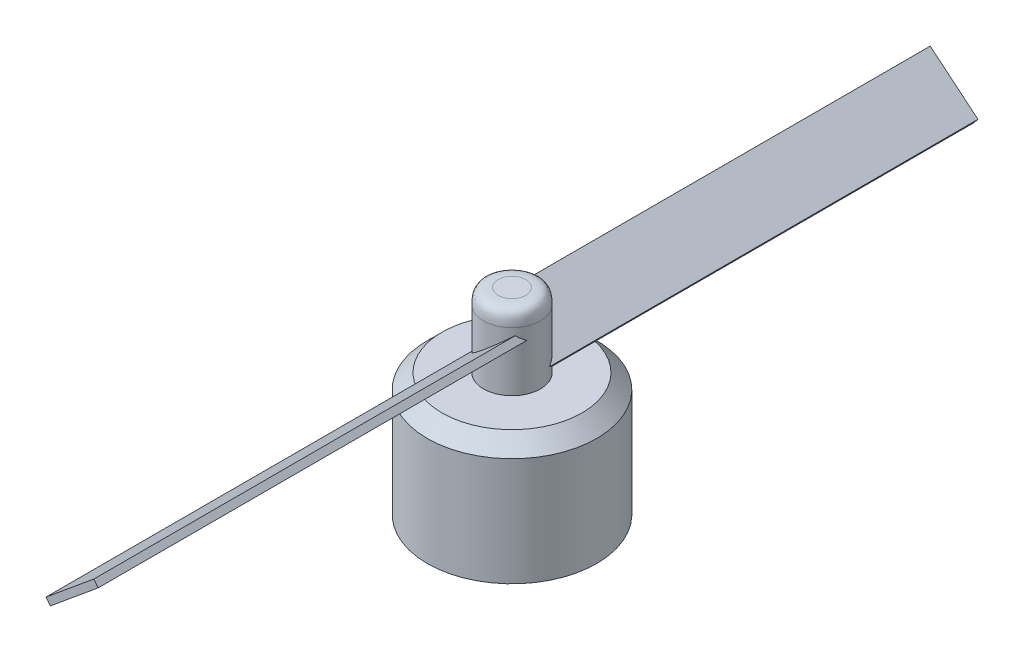
ISO-10303-21;
HEADER;
FILE_DESCRIPTION(('STEP AP214'),'2;1');
FILE_NAME('part.step','',(''),(''),'','','');
FILE_SCHEMA(('AUTOMOTIVE_DESIGN { 1 0 10303 214 1 1 1 1 }'));
ENDSEC;
DATA;
#1=APPLICATION_CONTEXT('core data for automotive mechanical design processes');
#2=APPLICATION_PROTOCOL_DEFINITION('international standard','automotive_design',2000,#1);
#3=PRODUCT_CONTEXT('',#1,'mechanical');
#4=PRODUCT('Part','Part','',(#3));
#5=PRODUCT_RELATED_PRODUCT_CATEGORY('part','',(#4));
#6=PRODUCT_DEFINITION_FORMATION('','',#4);
#7=PRODUCT_DEFINITION_CONTEXT('part definition',#1,'design');
#8=PRODUCT_DEFINITION('design','',#6,#7);
#9=PRODUCT_DEFINITION_SHAPE('','',#8);
#10=(LENGTH_UNIT() NAMED_UNIT(*) SI_UNIT(.MILLI.,.METRE.));
#11=(NAMED_UNIT(*) PLANE_ANGLE_UNIT() SI_UNIT($,.RADIAN.));
#12=(NAMED_UNIT(*) SI_UNIT($,.STERADIAN.) SOLID_ANGLE_UNIT());
#13=UNCERTAINTY_MEASURE_WITH_UNIT(LENGTH_MEASURE(1.E-05),#10,'distance_accuracy_value','');
#14=(GEOMETRIC_REPRESENTATION_CONTEXT(3) GLOBAL_UNCERTAINTY_ASSIGNED_CONTEXT((#13)) GLOBAL_UNIT_ASSIGNED_CONTEXT((#10,
#11,#12)) REPRESENTATION_CONTEXT('',''));
#15=CARTESIAN_POINT('',(0.,0.,0.));
#16=DIRECTION('',(0.,0.,1.));
#17=DIRECTION('',(1.,0.,0.));
#18=AXIS2_PLACEMENT_3D('',#15,#16,#17);
#19=CARTESIAN_POINT('',(0.,26.7,0.));
#20=DIRECTION('',(0.,-1.,0.));
#21=DIRECTION('',(0.,0.,-1.));
#22=AXIS2_PLACEMENT_3D('',#19,#20,#21);
#23=CYLINDRICAL_SURFACE('',#22,3.858432037408);
#24=CARTESIAN_POINT('',(0.,24.7,3.858432037408));
#25=CARTESIAN_POINT('',(0.505067548256472,24.7,3.858432037408));
#26=CARTESIAN_POINT('',(1.00993644525316,24.7,3.75800736988997));
#27=CARTESIAN_POINT('',(1.94317958599228,24.7,3.37144540400417));
#28=CARTESIAN_POINT('',(2.37118677006934,24.7,3.0854601467279));
#29=CARTESIAN_POINT('',(3.0854601467279,24.7,2.37118677006934));
#30=CARTESIAN_POINT('',(3.37144540400415,24.7,1.94317958599232));
#31=CARTESIAN_POINT('',(3.75800736988999,24.7,1.00993644525312));
#32=CARTESIAN_POINT('',(3.858432037408,24.7,0.505067548256251));
#33=CARTESIAN_POINT('',(3.858432037408,24.7,-0.50506754825625));
#34=CARTESIAN_POINT('',(3.75800736989,24.7,-1.0099364452531));
#35=CARTESIAN_POINT('',(3.37144540400414,24.7,-1.94317958599234));
#36=CARTESIAN_POINT('',(3.08546014672787,24.7,-2.37118677006938));
#37=CARTESIAN_POINT('',(2.37118677006937,24.7,-3.08546014672787));
#38=CARTESIAN_POINT('',(1.94317958599235,24.7,-3.37144540400414));
#39=CARTESIAN_POINT('',(1.00993644525309,24.7,-3.75800736989));
#40=CARTESIAN_POINT('',(0.505067548256251,24.7,-3.858432037408));
#41=CARTESIAN_POINT('',(-0.50506754825625,24.7,-3.858432037408));
#42=CARTESIAN_POINT('',(-1.00993644525304,24.7,-3.75800736989002));
#43=CARTESIAN_POINT('',(-1.94317958599239,24.7,-3.37144540400412));
#44=CARTESIAN_POINT('',(-2.37118677006937,24.7,-3.08546014672787));
#45=CARTESIAN_POINT('',(-3.08546014672787,24.7,-2.37118677006937));
#46=CARTESIAN_POINT('',(-3.37144540400413,24.7,-1.94317958599236));
#47=CARTESIAN_POINT('',(-3.75800736989001,24.7,-1.00993644525308));
#48=CARTESIAN_POINT('',(-3.858432037408,24.7,-0.505067548256245));
#49=CARTESIAN_POINT('',(-3.85843203740799,24.7,0.505067548256257));
#50=CARTESIAN_POINT('',(-3.75800736988998,24.7,1.00993644525313));
#51=CARTESIAN_POINT('',(-3.37144540400416,24.7,1.94317958599229));
#52=CARTESIAN_POINT('',(-3.08546014672784,24.7,2.37118677006939));
#53=CARTESIAN_POINT('',(-2.37118677006941,24.7,3.08546014672783));
#54=CARTESIAN_POINT('',(-1.94317958599236,24.7,3.37144540400413));
#55=CARTESIAN_POINT('',(-1.00993644525309,24.7,3.75800736989));
#56=CARTESIAN_POINT('',(-0.505067548256473,24.7,3.858432037408));
#57=CARTESIAN_POINT('',(0.,24.7,3.858432037408));
#58=(BOUNDED_CURVE() B_SPLINE_CURVE(3,(#24,#25,#26,#27,#28,#29,#30,#31,#32,#33,#34,#35,#36,#37,
#38,#39,#40,#41,#42,#43,#44,#45,#46,#47,#48,#49,#50,#51,#52,#53,#54,#55,#56,#57),.UNSPECIFIED.,
.T.,.F.) B_SPLINE_CURVE_WITH_KNOTS((4,2,2,2,2,2,2,2,2,2,2,2,2,2,2,2,4),(0.,0.392699081698724,
0.785398163397448,1.17809724509617,1.5707963267949,1.96349540849362,2.35619449019234,
2.74889357189107,3.14159265358979,3.53429173528852,3.92699081698724,4.31968989868597,
4.71238898038469,5.10508806208341,5.49778714378214,5.89048622548086,6.28318530717959),
.UNSPECIFIED.) CURVE() GEOMETRIC_REPRESENTATION_ITEM() RATIONAL_B_SPLINE_CURVE((1.,1.,1.,1.,1.,
1.,1.,1.,1.,1.,1.,1.,1.,1.,1.,1.,1.,1.,1.,1.,1.,1.,1.,1.,1.,1.,1.,1.,1.,1.,1.,1.,1.,1.)) REPRESENTATION_ITEM(''));
#59=CARTESIAN_POINT('',(0.,24.7,3.858432037408));
#60=VERTEX_POINT('',#59);
#61=EDGE_CURVE('E12',#60,#60,#58,.F.);
#62=ORIENTED_EDGE('',*,*,#61,.T.);
#63=EDGE_LOOP('',(#62));
#64=FACE_BOUND('',#63,.T.);
#65=CARTESIAN_POINT('',(0.,14.0969897316671,0.));
#66=DIRECTION('',(0.770742318559138,0.637146983342215,0.));
#67=DIRECTION('',(0.637146983342215,-0.770742318559138,0.));
#68=AXIS2_PLACEMENT_3D('',#65,#66,#67);
#69=ELLIPSE('',#68,6.05579581836553,3.858432037408);
#70=CARTESIAN_POINT('',(-3.54548194800131,18.3858791848945,1.52218774916017));
#71=VERTEX_POINT('',#70);
#72=CARTESIAN_POINT('',(-2.93967968421916,17.6530538658032,2.49915608585892));
#73=VERTEX_POINT('',#72);
#74=EDGE_CURVE('E178',#71,#73,#69,.T.);
#75=ORIENTED_EDGE('',*,*,#74,.F.);
#76=CARTESIAN_POINT('',(0.,21.3168109285756,0.));
#77=DIRECTION('',(0.637146983342215,-0.770742318559137,0.));
#78=DIRECTION('',(-0.770742318559138,-0.637146983342215,0.));
#79=AXIS2_PLACEMENT_3D('',#76,#77,#78);
#80=ELLIPSE('',#79,5.00612454318213,3.858432037408);
#81=CARTESIAN_POINT('',(2.93967968421918,23.7469461341968,2.4991560858589));
#82=VERTEX_POINT('',#81);
#83=EDGE_CURVE('E169',#82,#71,#80,.T.);
#84=ORIENTED_EDGE('',*,*,#83,.F.);
#85=CARTESIAN_POINT('',(0.,27.3030102683329,0.));
#86=DIRECTION('',(-0.770742318559139,-0.637146983342214,0.));
#87=DIRECTION('',(0.637146983342214,-0.770742318559139,0.));
#88=AXIS2_PLACEMENT_3D('',#85,#86,#87);
#89=ELLIPSE('',#88,6.05579581836554,3.858432037408);
#90=CARTESIAN_POINT('',(3.54548194800133,23.0141208151055,1.5221877491601));
#91=VERTEX_POINT('',#90);
#92=EDGE_CURVE('E172',#91,#82,#89,.T.);
#93=ORIENTED_EDGE('',*,*,#92,.F.);
#94=CARTESIAN_POINT('',(0.,20.0831890714244,0.));
#95=DIRECTION('',(-0.637146983342215,0.770742318559137,0.));
#96=DIRECTION('',(-0.770742318559138,-0.637146983342215,0.));
#97=AXIS2_PLACEMENT_3D('',#94,#95,#96);
#98=ELLIPSE('',#97,5.00612454318213,3.858432037408);
#99=EDGE_CURVE('E175',#73,#91,#98,.T.);
#100=ORIENTED_EDGE('',*,*,#99,.F.);
#101=EDGE_LOOP('',(#75,#84,#93,#100));
#102=FACE_BOUND('',#101,.T.);
#103=CARTESIAN_POINT('',(0.,16.7,0.));
#104=DIRECTION('',(0.,1.,0.));
#105=DIRECTION('',(0.,0.,1.));
#106=AXIS2_PLACEMENT_3D('',#103,#104,#105);
#107=CIRCLE('',#106,3.858432037408);
#108=CARTESIAN_POINT('',(0.,16.7,3.858432037408));
#109=VERTEX_POINT('',#108);
#110=EDGE_CURVE('E157',#109,#109,#107,.T.);
#111=ORIENTED_EDGE('',*,*,#110,.T.);
#112=EDGE_LOOP('',(#111));
#113=FACE_BOUND('',#112,.T.);
#114=CARTESIAN_POINT('',(0.,14.0969897316671,0.));
#115=DIRECTION('',(-0.770742318559138,0.637146983342215,0.));
#116=DIRECTION('',(-0.637146983342215,-0.770742318559138,0.));
#117=AXIS2_PLACEMENT_3D('',#114,#115,#116);
#118=ELLIPSE('',#117,6.05579581836553,3.858432037408);
#119=CARTESIAN_POINT('',(3.54548194800131,18.3858791848945,-1.52218774916017));
#120=VERTEX_POINT('',#119);
#121=CARTESIAN_POINT('',(2.93967968421916,17.6530538658032,-2.49915608585892));
#122=VERTEX_POINT('',#121);
#123=EDGE_CURVE('E130',#120,#122,#118,.T.);
#124=ORIENTED_EDGE('',*,*,#123,.F.);
#125=CARTESIAN_POINT('',(0.,21.3168109285756,0.));
#126=DIRECTION('',(-0.637146983342215,-0.770742318559137,0.));
#127=DIRECTION('',(0.770742318559138,-0.637146983342215,0.));
#128=AXIS2_PLACEMENT_3D('',#125,#126,#127);
#129=ELLIPSE('',#128,5.00612454318213,3.858432037408);
#130=CARTESIAN_POINT('',(-2.93967968421918,23.7469461341968,-2.4991560858589));
#131=VERTEX_POINT('',#130);
#132=EDGE_CURVE('E181',#131,#120,#129,.T.);
#133=ORIENTED_EDGE('',*,*,#132,.F.);
#134=CARTESIAN_POINT('',(0.,27.3030102683329,0.));
#135=DIRECTION('',(0.770742318559139,-0.637146983342214,0.));
#136=DIRECTION('',(-0.637146983342214,-0.770742318559139,0.));
#137=AXIS2_PLACEMENT_3D('',#134,#135,#136);
#138=ELLIPSE('',#137,6.05579581836554,3.858432037408);
#139=CARTESIAN_POINT('',(-3.54548194800133,23.0141208151055,-1.5221877491601));
#140=VERTEX_POINT('',#139);
#141=EDGE_CURVE('E66',#140,#131,#138,.T.);
#142=ORIENTED_EDGE('',*,*,#141,.F.);
#143=CARTESIAN_POINT('',(0.,20.0831890714244,0.));
#144=DIRECTION('',(0.637146983342215,0.770742318559137,0.));
#145=DIRECTION('',(0.770742318559138,-0.637146983342215,0.));
#146=AXIS2_PLACEMENT_3D('',#143,#144,#145);
#147=ELLIPSE('',#146,5.00612454318213,3.858432037408);
#148=EDGE_CURVE('E61',#122,#140,#147,.T.);
#149=ORIENTED_EDGE('',*,*,#148,.F.);
#150=EDGE_LOOP('',(#124,#133,#142,#149));
#151=FACE_BOUND('',#150,.T.);
#152=ADVANCED_FACE('F40',(#64,#102,#113,#151),#23,.T.);
#153=CARTESIAN_POINT('',(0.,16.7,0.));
#154=DIRECTION('',(0.,1.,0.));
#155=DIRECTION('',(0.,0.,1.));
#156=AXIS2_PLACEMENT_3D('',#153,#154,#155);
#157=PLANE('',#156);
#158=CARTESIAN_POINT('',(0.,16.7,0.));
#159=DIRECTION('',(0.,1.,0.));
#160=DIRECTION('',(0.,0.,1.));
#161=AXIS2_PLACEMENT_3D('',#158,#159,#160);
#162=CIRCLE('',#161,9.49999999999999);
#163=CARTESIAN_POINT('',(0.,16.7,9.49999999999999));
#164=VERTEX_POINT('',#163);
#165=EDGE_CURVE('E163',#164,#164,#162,.T.);
#166=ORIENTED_EDGE('',*,*,#165,.T.);
#167=EDGE_LOOP('',(#166));
#168=FACE_BOUND('',#167,.T.);
#169=ORIENTED_EDGE('',*,*,#110,.F.);
#170=EDGE_LOOP('',(#169));
#171=FACE_BOUND('',#170,.T.);
#172=ADVANCED_FACE('F210',(#168,#171),#157,.T.);
#173=CARTESIAN_POINT('',(0.,16.7,0.));
#174=DIRECTION('',(0.,-1.,0.));
#175=DIRECTION('',(0.,0.,-1.));
#176=AXIS2_PLACEMENT_3D('',#173,#174,#175);
#177=CYLINDRICAL_SURFACE('',#176,11.5);
#178=CARTESIAN_POINT('',(0.,14.7,0.));
#179=DIRECTION('',(0.,1.,0.));
#180=DIRECTION('',(0.,0.,1.));
#181=AXIS2_PLACEMENT_3D('',#178,#179,#180);
#182=CIRCLE('',#181,11.5);
#183=CARTESIAN_POINT('',(0.,14.7,11.5));
#184=VERTEX_POINT('',#183);
#185=EDGE_CURVE('E166',#184,#184,#182,.F.);
#186=ORIENTED_EDGE('',*,*,#185,.T.);
#187=EDGE_LOOP('',(#186));
#188=FACE_BOUND('',#187,.T.);
#189=CARTESIAN_POINT('',(0.,0.,0.));
#190=DIRECTION('',(0.,1.,0.));
#191=DIRECTION('',(0.,0.,1.));
#192=AXIS2_PLACEMENT_3D('',#189,#190,#191);
#193=CIRCLE('',#192,11.5);
#194=CARTESIAN_POINT('',(0.,0.,11.5));
#195=VERTEX_POINT('',#194);
#196=EDGE_CURVE('E160',#195,#195,#193,.T.);
#197=ORIENTED_EDGE('',*,*,#196,.T.);
#198=EDGE_LOOP('',(#197));
#199=FACE_BOUND('',#198,.T.);
#200=ADVANCED_FACE('F213',(#188,#199),#177,.T.);
#201=CARTESIAN_POINT('',(0.,0.,0.));
#202=DIRECTION('',(0.,1.,0.));
#203=DIRECTION('',(0.,0.,1.));
#204=AXIS2_PLACEMENT_3D('',#201,#202,#203);
#205=PLANE('',#204);
#206=ORIENTED_EDGE('',*,*,#196,.F.);
#207=EDGE_LOOP('',(#206));
#208=FACE_BOUND('',#207,.T.);
#209=ADVANCED_FACE('F215',(#208),#205,.F.);
#210=CARTESIAN_POINT('',(0.,16.7,0.));
#211=DIRECTION('',(0.,-1.,0.));
#212=DIRECTION('',(0.,0.,-1.));
#213=AXIS2_PLACEMENT_3D('',#210,#211,#212);
#214=CONICAL_SURFACE('',#213,9.49999999999999,0.785398163397447);
#215=ORIENTED_EDGE('',*,*,#185,.F.);
#216=EDGE_LOOP('',(#215));
#217=FACE_BOUND('',#216,.T.);
#218=ORIENTED_EDGE('',*,*,#165,.F.);
#219=EDGE_LOOP('',(#218));
#220=FACE_BOUND('',#219,.T.);
#221=ADVANCED_FACE('F207',(#217,#220),#214,.T.);
#222=CARTESIAN_POINT('',(0.,26.7,0.));
#223=DIRECTION('',(0.,1.,0.));
#224=DIRECTION('',(0.,0.,1.));
#225=AXIS2_PLACEMENT_3D('',#222,#223,#224);
#226=PLANE('',#225);
#227=CARTESIAN_POINT('',(0.,26.7,1.85843203740799));
#228=CARTESIAN_POINT('',(-0.0304078490313098,26.7,1.85843208659817));
#229=CARTESIAN_POINT('',(-0.0608150898767952,26.7,1.85767629258384));
#230=CARTESIAN_POINT('',(-0.121554992538284,26.7,1.85466735708799));
#231=CARTESIAN_POINT('',(-0.151887655549828,26.7,1.8524142397689));
#232=CARTESIAN_POINT('',(-0.212406572366194,26.7,1.84642494160648));
#233=CARTESIAN_POINT('',(-0.242592823517303,26.7,1.8426887339831));
#234=CARTESIAN_POINT('',(-0.302747511845807,26.7,1.83374752947818));
#235=CARTESIAN_POINT('',(-0.332715945164357,26.7,1.82854250663998));
#236=CARTESIAN_POINT('',(-0.392363471023844,26.7,1.81667787729016));
#237=CARTESIAN_POINT('',(-0.42204256356478,26.7,1.81001827077856));
#238=CARTESIAN_POINT('',(-0.481039910513281,26.7,1.79525865695951));
#239=CARTESIAN_POINT('',(-0.510358171288539,26.7,1.78715867510984));
#240=CARTESIAN_POINT('',(-0.568562321423554,26.7,1.76953250414313));
#241=CARTESIAN_POINT('',(-0.597448218581264,26.7,1.76000634078236));
#242=CARTESIAN_POINT('',(-0.654716204909586,26.7,1.73954198389621));
#243=CARTESIAN_POINT('',(-0.683098285942751,26.7,1.72860376758745));
#244=CARTESIAN_POINT('',(-0.739284015842332,26.7,1.70533087626154));
#245=CARTESIAN_POINT('',(-0.767087664708751,26.7,1.69299620124441));
#246=CARTESIAN_POINT('',(-0.822052731750569,26.7,1.66697210523672));
#247=CARTESIAN_POINT('',(-0.84921416028221,26.7,1.65328270611049));
#248=CARTESIAN_POINT('',(-0.902834294396102,26.7,1.62458974208344));
#249=CARTESIAN_POINT('',(-0.929292987279904,26.7,1.6095861534562));
#250=CARTESIAN_POINT('',(-0.981447034987801,26.7,1.578305351594));
#251=CARTESIAN_POINT('',(-1.0071423763132,26.7,1.56202811585502));
#252=CARTESIAN_POINT('',(-1.05770910399782,26.7,1.52824050862675));
#253=CARTESIAN_POINT('',(-1.08258049035705,26.7,1.51073013713746));
#254=CARTESIAN_POINT('',(-1.13143867294673,26.7,1.47451672454592));
#255=CARTESIAN_POINT('',(-1.15542548480246,26.7,1.45581370452676));
#256=CARTESIAN_POINT('',(-1.20245386396038,26.7,1.41725548204834));
#257=CARTESIAN_POINT('',(-1.22549544832343,26.7,1.39740030040062));
#258=CARTESIAN_POINT('',(-1.27057279849405,26.7,1.35657819033711));
#259=CARTESIAN_POINT('',(-1.29260854806476,26.7,1.33561124398629));
#260=CARTESIAN_POINT('',(-1.3356112439863,26.7,1.29260854806475));
#261=CARTESIAN_POINT('',(-1.35657819033712,26.7,1.27057279849405));
#262=CARTESIAN_POINT('',(-1.39740030040064,26.7,1.22549544832343));
#263=CARTESIAN_POINT('',(-1.41725548204836,26.7,1.20245386396038));
#264=CARTESIAN_POINT('',(-1.45581370452679,26.7,1.15542548480246));
#265=CARTESIAN_POINT('',(-1.47451672454595,26.7,1.13143867294675));
#266=CARTESIAN_POINT('',(-1.51073013713749,26.7,1.08258049035704));
#267=CARTESIAN_POINT('',(-1.52824050862678,26.7,1.05770910399777));
#268=CARTESIAN_POINT('',(-1.56202811585506,26.7,1.00714237631324));
#269=CARTESIAN_POINT('',(-1.57830535159406,26.7,0.981447034987977));
#270=CARTESIAN_POINT('',(-1.60958615345621,26.7,0.929292987279719));
#271=CARTESIAN_POINT('',(-1.62458974208338,26.7,0.902834294395426));
#272=CARTESIAN_POINT('',(-1.65328270611061,26.7,0.849214160282872));
#273=CARTESIAN_POINT('',(-1.66697210523709,26.7,0.822052731753061));
#274=CARTESIAN_POINT('',(-1.69299620124407,26.7,0.767087664706243));
#275=CARTESIAN_POINT('',(-1.70533087626025,26.7,0.739284015832996));
#276=CARTESIAN_POINT('',(-1.72860376758875,26.7,0.683098285952075));
#277=CARTESIAN_POINT('',(-1.73954198390108,26.7,0.654716204944402));
#278=CARTESIAN_POINT('',(-1.76000634077747,26.7,0.597448218546435));
#279=CARTESIAN_POINT('',(-1.76953250412491,26.7,0.568562321293592));
#280=CARTESIAN_POINT('',(-1.78715867512802,26.7,0.510358171418475));
#281=CARTESIAN_POINT('',(-1.79525865702743,26.7,0.481039910998257));
#282=CARTESIAN_POINT('',(-1.81001827071059,26.7,0.422042563079746));
#283=CARTESIAN_POINT('',(-1.81667787703657,26.7,0.392363469213731));
#284=CARTESIAN_POINT('',(-1.82854250689353,26.7,0.332715946974398));
#285=CARTESIAN_POINT('',(-1.83374753042451,26.7,0.30274751860108));
#286=CARTESIAN_POINT('',(-1.84268873303676,26.7,0.242592816762066));
#287=CARTESIAN_POINT('',(-1.84642493807477,26.7,0.212406547155628));
#288=CARTESIAN_POINT('',(-1.85241424330054,26.7,0.15188768075986));
#289=CARTESIAN_POINT('',(-1.85466737026815,26.7,0.121555086622664));
#290=CARTESIAN_POINT('',(-1.85767627940346,26.7,0.0608149957908471));
#291=CARTESIAN_POINT('',(-1.85843203740799,26.7,0.030407497895425));
#292=CARTESIAN_POINT('',(-1.858432037408,26.7,-0.0304074978954191));
#293=CARTESIAN_POINT('',(-1.85767627940346,26.7,-0.0608149957908412));
#294=CARTESIAN_POINT('',(-1.85466737026815,26.7,-0.121555086622658));
#295=CARTESIAN_POINT('',(-1.85241424330055,26.7,-0.151887680759854));
#296=CARTESIAN_POINT('',(-1.84642493807477,26.7,-0.212406547155622));
#297=CARTESIAN_POINT('',(-1.84268873303677,26.7,-0.24259281676206));
#298=CARTESIAN_POINT('',(-1.83374753042451,26.7,-0.302747518601074));
#299=CARTESIAN_POINT('',(-1.82854250689354,26.7,-0.332715946974393));
#300=CARTESIAN_POINT('',(-1.81667787703658,26.7,-0.392363469213726));
#301=CARTESIAN_POINT('',(-1.8100182707106,26.7,-0.422042563079741));
#302=CARTESIAN_POINT('',(-1.79525865702744,26.7,-0.481039910998253));
#303=CARTESIAN_POINT('',(-1.78715867512803,26.7,-0.510358171418472));
#304=CARTESIAN_POINT('',(-1.76953250412491,26.7,-0.568562321293591));
#305=CARTESIAN_POINT('',(-1.76000634077747,26.7,-0.597448218546435));
#306=CARTESIAN_POINT('',(-1.73954198390108,26.7,-0.654716204944404));
#307=CARTESIAN_POINT('',(-1.72860376758875,26.7,-0.683098285952079));
#308=CARTESIAN_POINT('',(-1.70533087626024,26.7,-0.739284015833002));
#309=CARTESIAN_POINT('',(-1.69299620124406,26.7,-0.76708766470625));
#310=CARTESIAN_POINT('',(-1.66697210523708,26.7,-0.82205273175307));
#311=CARTESIAN_POINT('',(-1.6532827061106,26.7,-0.849214160282881));
#312=CARTESIAN_POINT('',(-1.62458974208337,26.7,-0.902834294395434));
#313=CARTESIAN_POINT('',(-1.6095861534562,26.7,-0.929292987279727));
#314=CARTESIAN_POINT('',(-1.57830535159405,26.7,-0.981447034987983));
#315=CARTESIAN_POINT('',(-1.56202811585505,26.7,-1.00714237631325));
#316=CARTESIAN_POINT('',(-1.52824050862677,26.7,-1.05770910399778));
#317=CARTESIAN_POINT('',(-1.51073013713748,26.7,-1.08258049035704));
#318=CARTESIAN_POINT('',(-1.47451672454595,26.7,-1.13143867294675));
#319=CARTESIAN_POINT('',(-1.45581370452679,26.7,-1.15542548480247));
#320=CARTESIAN_POINT('',(-1.41725548204836,26.7,-1.20245386396038));
#321=CARTESIAN_POINT('',(-1.39740030040064,26.7,-1.22549544832343));
#322=CARTESIAN_POINT('',(-1.35657819033712,26.7,-1.27057279849405));
#323=CARTESIAN_POINT('',(-1.3356112439863,26.7,-1.29260854806476));
#324=CARTESIAN_POINT('',(-1.29260854806476,26.7,-1.33561124398629));
#325=CARTESIAN_POINT('',(-1.27057279849404,26.7,-1.35657819033711));
#326=CARTESIAN_POINT('',(-1.22549544832343,26.7,-1.39740030040062));
#327=CARTESIAN_POINT('',(-1.20245386396037,26.7,-1.41725548204835));
#328=CARTESIAN_POINT('',(-1.15542548480246,26.7,-1.45581370452677));
#329=CARTESIAN_POINT('',(-1.13143867294674,26.7,-1.47451672454593));
#330=CARTESIAN_POINT('',(-1.08258049035704,26.7,-1.51073013713746));
#331=CARTESIAN_POINT('',(-1.05770910399777,26.7,-1.52824050862675));
#332=CARTESIAN_POINT('',(-1.00714237631324,26.7,-1.56202811585504));
#333=CARTESIAN_POINT('',(-0.981447034987979,26.7,-1.57830535159403));
#334=CARTESIAN_POINT('',(-0.929292987279724,26.7,-1.60958615345618));
#335=CARTESIAN_POINT('',(-0.902834294395432,26.7,-1.62458974208335));
#336=CARTESIAN_POINT('',(-0.849214160282879,26.7,-1.65328270611059));
#337=CARTESIAN_POINT('',(-0.822052731753068,26.7,-1.66697210523707));
#338=CARTESIAN_POINT('',(-0.767087664706248,26.7,-1.69299620124406));
#339=CARTESIAN_POINT('',(-0.739284015832998,26.7,-1.70533087626024));
#340=CARTESIAN_POINT('',(-0.683098285952073,26.7,-1.72860376758875));
#341=CARTESIAN_POINT('',(-0.654716204944398,26.7,-1.73954198390109));
#342=CARTESIAN_POINT('',(-0.597448218546427,26.7,-1.76000634077748));
#343=CARTESIAN_POINT('',(-0.568562321293583,26.7,-1.76953250412493));
#344=CARTESIAN_POINT('',(-0.510358171418463,26.7,-1.78715867512804));
#345=CARTESIAN_POINT('',(-0.481039910998245,26.7,-1.79525865702746));
#346=CARTESIAN_POINT('',(-0.422042563079734,26.7,-1.81001827071061));
#347=CARTESIAN_POINT('',(-0.39236346921372,26.7,-1.81667787703659));
#348=CARTESIAN_POINT('',(-0.332715946974388,26.7,-1.82854250689355));
#349=CARTESIAN_POINT('',(-0.30274751860107,26.7,-1.83374753042452));
#350=CARTESIAN_POINT('',(-0.242592816762058,26.7,-1.84268873303677));
#351=CARTESIAN_POINT('',(-0.212406547155621,26.7,-1.84642493807477));
#352=CARTESIAN_POINT('',(-0.151887680759855,26.7,-1.85241424330055));
#353=CARTESIAN_POINT('',(-0.12155508662266,26.7,-1.85466737026815));
#354=CARTESIAN_POINT('',(-0.0608149957908433,26.7,-1.85767627940346));
#355=CARTESIAN_POINT('',(-0.0304074978954215,26.7,-1.85843203740799));
#356=CARTESIAN_POINT('',(0.0304074978954224,26.7,-1.85843203740799));
#357=CARTESIAN_POINT('',(0.0608149957908446,26.7,-1.85767627940346));
#358=CARTESIAN_POINT('',(0.121555086622662,26.7,-1.85466737026815));
#359=CARTESIAN_POINT('',(0.151887680759858,26.7,-1.85241424330055));
#360=CARTESIAN_POINT('',(0.212406547155627,26.7,-1.84642493807477));
#361=CARTESIAN_POINT('',(0.242592816762065,26.7,-1.84268873303677));
#362=CARTESIAN_POINT('',(0.30274751860108,26.7,-1.83374753042452));
#363=CARTESIAN_POINT('',(0.332715946974399,26.7,-1.82854250689355));
#364=CARTESIAN_POINT('',(0.392363469213733,26.7,-1.81667787703659));
#365=CARTESIAN_POINT('',(0.422042563079748,26.7,-1.81001827071061));
#366=CARTESIAN_POINT('',(0.48103991099826,26.7,-1.79525865702746));
#367=CARTESIAN_POINT('',(0.510358171418479,26.7,-1.78715867512804));
#368=CARTESIAN_POINT('',(0.568562321293597,26.7,-1.76953250412492));
#369=CARTESIAN_POINT('',(0.597448218546441,26.7,-1.76000634077748));
#370=CARTESIAN_POINT('',(0.654716204944408,26.7,-1.73954198390109));
#371=CARTESIAN_POINT('',(0.683098285952081,26.7,-1.72860376758875));
#372=CARTESIAN_POINT('',(0.739284015833001,26.7,-1.70533087626024));
#373=CARTESIAN_POINT('',(0.767087664706248,26.7,-1.69299620124406));
#374=CARTESIAN_POINT('',(0.822052731753066,26.7,-1.66697210523707));
#375=CARTESIAN_POINT('',(0.849214160282876,26.7,-1.65328270611059));
#376=CARTESIAN_POINT('',(0.902834294395429,26.7,-1.62458974208335));
#377=CARTESIAN_POINT('',(0.929292987279722,26.7,-1.60958615345618));
#378=CARTESIAN_POINT('',(0.981447034987978,26.7,-1.57830535159403));
#379=CARTESIAN_POINT('',(1.00714237631324,26.7,-1.56202811585504));
#380=CARTESIAN_POINT('',(1.05770910399777,26.7,-1.52824050862675));
#381=CARTESIAN_POINT('',(1.08258049035704,26.7,-1.51073013713746));
#382=CARTESIAN_POINT('',(1.13143867294675,26.7,-1.47451672454593));
#383=CARTESIAN_POINT('',(1.15542548480246,26.7,-1.45581370452677));
#384=CARTESIAN_POINT('',(1.20245386396038,26.7,-1.41725548204835));
#385=CARTESIAN_POINT('',(1.22549544832343,26.7,-1.39740030040063));
#386=CARTESIAN_POINT('',(1.27057279849405,26.7,-1.35657819033712));
#387=CARTESIAN_POINT('',(1.29260854806476,26.7,-1.33561124398629));
#388=CARTESIAN_POINT('',(1.33561124398629,26.7,-1.29260854806476));
#389=CARTESIAN_POINT('',(1.35657819033712,26.7,-1.27057279849405));
#390=CARTESIAN_POINT('',(1.39740030040063,26.7,-1.22549544832343));
#391=CARTESIAN_POINT('',(1.41725548204835,26.7,-1.20245386396038));
#392=CARTESIAN_POINT('',(1.45581370452678,26.7,-1.15542548480247));
#393=CARTESIAN_POINT('',(1.47451672454594,26.7,-1.13143867294675));
#394=CARTESIAN_POINT('',(1.51073013713748,26.7,-1.08258049035705));
#395=CARTESIAN_POINT('',(1.52824050862676,26.7,-1.05770910399778));
#396=CARTESIAN_POINT('',(1.56202811585505,26.7,-1.00714237631325));
#397=CARTESIAN_POINT('',(1.57830535159405,26.7,-0.981447034987984));
#398=CARTESIAN_POINT('',(1.6095861534562,26.7,-0.929292987279727));
#399=CARTESIAN_POINT('',(1.62458974208337,26.7,-0.902834294395434));
#400=CARTESIAN_POINT('',(1.6532827061106,26.7,-0.84921416028288));
#401=CARTESIAN_POINT('',(1.66697210523708,26.7,-0.822052731753069));
#402=CARTESIAN_POINT('',(1.69299620124407,26.7,-0.767087664706249));
#403=CARTESIAN_POINT('',(1.70533087626024,26.7,-0.739284015833001));
#404=CARTESIAN_POINT('',(1.72860376758875,26.7,-0.683098285952077));
#405=CARTESIAN_POINT('',(1.73954198390108,26.7,-0.654716204944403));
#406=CARTESIAN_POINT('',(1.76000634077747,26.7,-0.597448218546434));
#407=CARTESIAN_POINT('',(1.76953250412491,26.7,-0.56856232129359));
#408=CARTESIAN_POINT('',(1.78715867512803,26.7,-0.510358171418472));
#409=CARTESIAN_POINT('',(1.79525865702744,26.7,-0.481039910998253));
#410=CARTESIAN_POINT('',(1.8100182707106,26.7,-0.422042563079741));
#411=CARTESIAN_POINT('',(1.81667787703658,26.7,-0.392363469213726));
#412=CARTESIAN_POINT('',(1.82854250689353,26.7,-0.332715946974393));
#413=CARTESIAN_POINT('',(1.83374753042451,26.7,-0.302747518601075));
#414=CARTESIAN_POINT('',(1.84268873303676,26.7,-0.242592816762062));
#415=CARTESIAN_POINT('',(1.84642493807477,26.7,-0.212406547155624));
#416=CARTESIAN_POINT('',(1.85241424330055,26.7,-0.151887680759857));
#417=CARTESIAN_POINT('',(1.85466737026815,26.7,-0.121555086622661));
#418=CARTESIAN_POINT('',(1.85767627940346,26.7,-0.0608149957908442));
#419=CARTESIAN_POINT('',(1.85843203740799,26.7,-0.030407497895422));
#420=CARTESIAN_POINT('',(1.85843203740799,26.7,0.0304074978954224));
#421=CARTESIAN_POINT('',(1.85767627940346,26.7,0.0608149957908447));
#422=CARTESIAN_POINT('',(1.85466737026815,26.7,0.121555086622662));
#423=CARTESIAN_POINT('',(1.85241424330055,26.7,0.151887680759858));
#424=CARTESIAN_POINT('',(1.84642493807477,26.7,0.212406547155626));
#425=CARTESIAN_POINT('',(1.84268873303676,26.7,0.242592816762065));
#426=CARTESIAN_POINT('',(1.83374753042451,26.7,0.302747518601079));
#427=CARTESIAN_POINT('',(1.82854250689353,26.7,0.332715946974397));
#428=CARTESIAN_POINT('',(1.81667787703658,26.7,0.392363469213731));
#429=CARTESIAN_POINT('',(1.8100182707106,26.7,0.422042563079746));
#430=CARTESIAN_POINT('',(1.79525865702744,26.7,0.481039910998258));
#431=CARTESIAN_POINT('',(1.78715867512803,26.7,0.510358171418477));
#432=CARTESIAN_POINT('',(1.76953250412491,26.7,0.568562321293594));
#433=CARTESIAN_POINT('',(1.76000634077747,26.7,0.597448218546438));
#434=CARTESIAN_POINT('',(1.73954198390108,26.7,0.654716204944404));
#435=CARTESIAN_POINT('',(1.72860376758875,26.7,0.683098285952078));
#436=CARTESIAN_POINT('',(1.70533087626024,26.7,0.739284015832998));
#437=CARTESIAN_POINT('',(1.69299620124407,26.7,0.767087664706244));
#438=CARTESIAN_POINT('',(1.66697210523708,26.7,0.822052731753061));
#439=CARTESIAN_POINT('',(1.65328270611061,26.7,0.84921416028287));
#440=CARTESIAN_POINT('',(1.62458974208337,26.7,0.902834294395421));
#441=CARTESIAN_POINT('',(1.6095861534562,26.7,0.929292987279712));
#442=CARTESIAN_POINT('',(1.57830535159405,26.7,0.981447034987967));
#443=CARTESIAN_POINT('',(1.56202811585505,26.7,1.00714237631323));
#444=CARTESIAN_POINT('',(1.52824050862677,26.7,1.05770910399776));
#445=CARTESIAN_POINT('',(1.51073013713748,26.7,1.08258049035703));
#446=CARTESIAN_POINT('',(1.47451672454594,26.7,1.13143867294673));
#447=CARTESIAN_POINT('',(1.45581370452678,26.7,1.15542548480245));
#448=CARTESIAN_POINT('',(1.41725548204835,26.7,1.20245386396036));
#449=CARTESIAN_POINT('',(1.39740030040063,26.7,1.22549544832342));
#450=CARTESIAN_POINT('',(1.35657819033712,26.7,1.27057279849404));
#451=CARTESIAN_POINT('',(1.33561124398629,26.7,1.29260854806475));
#452=CARTESIAN_POINT('',(1.29260854806476,26.7,1.3356112439863));
#453=CARTESIAN_POINT('',(1.27057279849404,26.7,1.35657819033712));
#454=CARTESIAN_POINT('',(1.22549544832343,26.7,1.39740030040064));
#455=CARTESIAN_POINT('',(1.20245386396038,26.7,1.41725548204837));
#456=CARTESIAN_POINT('',(1.15542548480246,26.7,1.4558137045268));
#457=CARTESIAN_POINT('',(1.13143867294673,26.7,1.47451672454596));
#458=CARTESIAN_POINT('',(1.08258049035705,26.7,1.5107301371375));
#459=CARTESIAN_POINT('',(1.05770910399782,26.7,1.52824050862679));
#460=CARTESIAN_POINT('',(1.00714237631319,26.7,1.56202811585507));
#461=CARTESIAN_POINT('',(0.981447034987796,26.7,1.57830535159405));
#462=CARTESIAN_POINT('',(0.929292987279898,26.7,1.60958615345624));
#463=CARTESIAN_POINT('',(0.902834294396096,26.7,1.62458974208348));
#464=CARTESIAN_POINT('',(0.849214160282203,26.7,1.65328270611052));
#465=CARTESIAN_POINT('',(0.822052731750563,26.7,1.66697210523674));
#466=CARTESIAN_POINT('',(0.767087664708746,26.7,1.69299620124442));
#467=CARTESIAN_POINT('',(0.739284015842329,26.7,1.70533087626155));
#468=CARTESIAN_POINT('',(0.683098285942749,26.7,1.72860376758744));
#469=CARTESIAN_POINT('',(0.654716204909587,26.7,1.7395419838962));
#470=CARTESIAN_POINT('',(0.597448218581267,26.7,1.76000634078234));
#471=CARTESIAN_POINT('',(0.568562321423557,26.7,1.7695325041431));
#472=CARTESIAN_POINT('',(0.510358171288543,26.7,1.78715867510981));
#473=CARTESIAN_POINT('',(0.481039910513285,26.7,1.79525865695948));
#474=CARTESIAN_POINT('',(0.422042563564783,26.7,1.81001827077853));
#475=CARTESIAN_POINT('',(0.392363471023847,26.7,1.81667787729014));
#476=CARTESIAN_POINT('',(0.33271594516436,26.7,1.82854250663995));
#477=CARTESIAN_POINT('',(0.30274751184581,26.7,1.83374752947816));
#478=CARTESIAN_POINT('',(0.242592823517306,26.7,1.84268873398308));
#479=CARTESIAN_POINT('',(0.212406572366196,26.7,1.84642494160647));
#480=CARTESIAN_POINT('',(0.15188765554983,26.7,1.8524142397689));
#481=CARTESIAN_POINT('',(0.121554992538285,26.7,1.85466735708798));
#482=CARTESIAN_POINT('',(0.0608150898767958,26.7,1.85767629258384));
#483=CARTESIAN_POINT('',(0.0304078490313101,26.7,1.85843208659817));
#484=CARTESIAN_POINT('',(0.,26.7,1.85843203740799));
#485=B_SPLINE_CURVE_WITH_KNOTS('',3,(#227,#228,#229,#230,#231,#232,#233,#234,#235,#236,#237,
#238,#239,#240,#241,#242,#243,#244,#245,#246,#247,#248,#249,#250,#251,#252,#253,#254,#255,#256,
#257,#258,#259,#260,#261,#262,#263,#264,#265,#266,#267,#268,#269,#270,#271,#272,#273,#274,#275,
#276,#277,#278,#279,#280,#281,#282,#283,#284,#285,#286,#287,#288,#289,#290,#291,#292,#293,#294,
#295,#296,#297,#298,#299,#300,#301,#302,#303,#304,#305,#306,#307,#308,#309,#310,#311,#312,#313,
#314,#315,#316,#317,#318,#319,#320,#321,#322,#323,#324,#325,#326,#327,#328,#329,#330,#331,#332,
#333,#334,#335,#336,#337,#338,#339,#340,#341,#342,#343,#344,#345,#346,#347,#348,#349,#350,#351,
#352,#353,#354,#355,#356,#357,#358,#359,#360,#361,#362,#363,#364,#365,#366,#367,#368,#369,#370,
#371,#372,#373,#374,#375,#376,#377,#378,#379,#380,#381,#382,#383,#384,#385,#386,#387,#388,#389,
#390,#391,#392,#393,#394,#395,#396,#397,#398,#399,#400,#401,#402,#403,#404,#405,#406,#407,#408,
#409,#410,#411,#412,#413,#414,#415,#416,#417,#418,#419,#420,#421,#422,#423,#424,#425,#426,#427,
#428,#429,#430,#431,#432,#433,#434,#435,#436,#437,#438,#439,#440,#441,#442,#443,#444,#445,#446,
#447,#448,#449,#450,#451,#452,#453,#454,#455,#456,#457,#458,#459,#460,#461,#462,#463,#464,#465,
#466,#467,#468,#469,#470,#471,#472,#473,#474,#475,#476,#477,#478,#479,#480,#481,#482,#483,#484),
.UNSPECIFIED.,.F.,.F.,(4,2,2,2,2,2,2,2,2,2,2,2,2,2,2,2,2,2,2,2,2,2,2,2,2,2,2,2,2,2,2,2,2,2,2,2,
2,2,2,2,2,2,2,2,2,2,2,2,2,2,2,2,2,2,2,2,2,2,2,2,2,2,2,2,2,2,2,2,2,2,2,2,2,2,2,2,2,2,2,2,2,2,2,2,
2,2,2,2,2,2,2,2,2,2,2,2,2,2,2,2,2,2,2,2,2,2,2,2,2,2,2,2,2,2,2,2,2,2,2,2,2,2,2,2,2,2,2,2,4),(0.,
0.0912132942245355,0.182425116568105,0.273638585991662,0.364853667426314,0.456068748860963,
0.547282218284505,0.638494040628053,0.729707334852562,0.820920629077073,0.912132451420633,
1.00334592084419,1.09456100227885,1.18577608371351,1.27698955313706,1.36820137548062,
1.45941466970511,1.55062796392961,1.64183978627317,1.73305325569673,1.82426833713139,
1.91548341856605,2.00669688798961,2.09790871033317,2.18912200455767,2.28033529878217,
2.37154712112573,2.46276059054928,2.55397567198394,2.6451907534186,2.73640422284216,
2.82761604518571,2.91882933941022,3.01004263363472,3.10125445597828,3.19246792540183,
3.28368300683649,3.37489808827115,3.46611155769471,3.55732338003827,3.64853667426278,
3.73974996848729,3.83096179083084,3.9221752602544,4.01339034168906,4.10460542312372,
4.19581889254727,4.28703071489083,4.37824400911533,4.46945730333983,4.56066912568339,
4.65188259510694,4.74309767654159,4.83431275797625,4.92552622739981,5.01673804974337,
5.10795134396788,5.1991646381924,5.29037646053596,5.38158992995951,5.47280501139417,
5.56402009282883,5.65523356225238,5.74644538459593,5.83765867882044,5.92887197304494,
6.0200837953885,6.11129726481206,6.20251234624672,6.29372742768138,6.38494089710493,
6.47615271944849,6.567366013673,6.6585793078975,6.74979113024106,6.84100459966462,
6.93221968109928,7.02343476253394,7.11464823195749,7.20586005430105,7.29707334852554,
7.38828664275004,7.4794984650936,7.57071193451715,7.66192701595181,7.75314209738648,
7.84435556681003,7.93556738915359,8.0267806833781,8.11799397760261,8.20920579994616,
8.30041926936972,8.39163435080438,8.48284943223904,8.57406290166259,8.66527472400615,
8.75648801823065,8.84770131245516,8.93891313479872,9.03012660422227,9.12134168565693,
9.21255676709159,9.30377023651515,9.3949820588587,9.48619535308321,9.57740864730771,
9.66862046965126,9.75983393907481,9.85104902050947,9.94226410194413,10.0334775713677,
10.1246893937112,10.2159026879358,10.3071159821603,10.3983278045038,10.4895412739274,
10.580756355362,10.6719714367967,10.7631849062203,10.8543967285638,10.9456100227883,
11.0368233170128,11.1280351393564,11.2192486087799,11.3104636902146,11.4016787716492,
11.4928922410728,11.5841040634163,11.6753173576409),.UNSPECIFIED.);
#486=CARTESIAN_POINT('',(0.,26.7,1.85843203740799));
#487=VERTEX_POINT('',#486);
#488=EDGE_CURVE('E54',#487,#487,#485,.F.);
#489=ORIENTED_EDGE('',*,*,#488,.T.);
#490=EDGE_LOOP('',(#489));
#491=FACE_BOUND('',#490,.T.);
#492=ADVANCED_FACE('F196',(#491),#226,.T.);
#493=CARTESIAN_POINT('',(-3.54548194800131,18.3858791848945,59.69));
#494=DIRECTION('',(0.770742318559138,0.637146983342215,0.));
#495=DIRECTION('',(-0.637146983342215,0.770742318559138,0.));
#496=AXIS2_PLACEMENT_3D('',#493,#494,#495);
#497=PLANE('',#496);
#498=DIRECTION('',(0.,0.,-1.));
#499=VECTOR('',#498,1.);
#500=CARTESIAN_POINT('',(-3.54548194800131,18.3858791848945,59.69));
#501=LINE('',#500,#499);
#502=CARTESIAN_POINT('',(-3.54548194800131,18.3858791848945,59.69));
#503=VERTEX_POINT('',#502);
#504=EDGE_CURVE('E145',#503,#71,#501,.T.);
#505=ORIENTED_EDGE('',*,*,#504,.T.);
#506=ORIENTED_EDGE('',*,*,#74,.T.);
#507=DIRECTION('',(0.,0.,-1.));
#508=VECTOR('',#507,1.);
#509=CARTESIAN_POINT('',(-2.93967968421916,17.6530538658032,59.69));
#510=LINE('',#509,#508);
#511=CARTESIAN_POINT('',(-2.93967968421916,17.6530538658032,59.69));
#512=VERTEX_POINT('',#511);
#513=EDGE_CURVE('E154',#512,#73,#510,.T.);
#514=ORIENTED_EDGE('',*,*,#513,.F.);
#515=DIRECTION('',(0.637146983342215,-0.770742318559138,0.));
#516=VECTOR('',#515,1.);
#517=CARTESIAN_POINT('',(-3.54548194800131,18.3858791848945,59.69));
#518=LINE('',#517,#516);
#519=EDGE_CURVE('E131',#503,#512,#518,.T.);
#520=ORIENTED_EDGE('',*,*,#519,.F.);
#521=EDGE_LOOP('',(#505,#506,#514,#520));
#522=FACE_BOUND('',#521,.T.);
#523=ADVANCED_FACE('F206',(#522),#497,.F.);
#524=CARTESIAN_POINT('',(-2.93967968421916,17.6530538658032,59.69));
#525=DIRECTION('',(-0.637146983342215,0.770742318559137,0.));
#526=DIRECTION('',(-0.770742318559138,-0.637146983342215,0.));
#527=AXIS2_PLACEMENT_3D('',#524,#525,#526);
#528=PLANE('',#527);
#529=ORIENTED_EDGE('',*,*,#513,.T.);
#530=ORIENTED_EDGE('',*,*,#99,.T.);
#531=DIRECTION('',(0.,0.,-1.));
#532=VECTOR('',#531,1.);
#533=CARTESIAN_POINT('',(3.54548194800133,23.0141208151055,59.69));
#534=LINE('',#533,#532);
#535=CARTESIAN_POINT('',(3.54548194800133,23.0141208151055,59.69));
#536=VERTEX_POINT('',#535);
#537=EDGE_CURVE('E151',#536,#91,#534,.T.);
#538=ORIENTED_EDGE('',*,*,#537,.F.);
#539=DIRECTION('',(0.770742318559137,0.637146983342215,0.));
#540=VECTOR('',#539,1.);
#541=CARTESIAN_POINT('',(-2.93967968421916,17.6530538658032,59.69));
#542=LINE('',#541,#540);
#543=EDGE_CURVE('E134',#512,#536,#542,.T.);
#544=ORIENTED_EDGE('',*,*,#543,.F.);
#545=EDGE_LOOP('',(#529,#530,#538,#544));
#546=FACE_BOUND('',#545,.T.);
#547=ADVANCED_FACE('F269',(#546),#528,.F.);
#548=CARTESIAN_POINT('',(2.93967968421918,23.7469461341968,59.69));
#549=DIRECTION('',(-0.770742318559139,-0.637146983342214,0.));
#550=DIRECTION('',(0.637146983342214,-0.770742318559139,0.));
#551=AXIS2_PLACEMENT_3D('',#548,#549,#550);
#552=PLANE('',#551);
#553=ORIENTED_EDGE('',*,*,#537,.T.);
#554=ORIENTED_EDGE('',*,*,#92,.T.);
#555=DIRECTION('',(0.,0.,-1.));
#556=VECTOR('',#555,1.);
#557=CARTESIAN_POINT('',(2.93967968421918,23.7469461341968,59.69));
#558=LINE('',#557,#556);
#559=CARTESIAN_POINT('',(2.93967968421918,23.7469461341968,59.69));
#560=VERTEX_POINT('',#559);
#561=EDGE_CURVE('E148',#560,#82,#558,.T.);
#562=ORIENTED_EDGE('',*,*,#561,.F.);
#563=DIRECTION('',(-0.637146983342214,0.770742318559139,0.));
#564=VECTOR('',#563,1.);
#565=CARTESIAN_POINT('',(2.93967968421918,23.7469461341968,59.69));
#566=LINE('',#565,#564);
#567=EDGE_CURVE('E141',#536,#560,#566,.T.);
#568=ORIENTED_EDGE('',*,*,#567,.F.);
#569=EDGE_LOOP('',(#553,#554,#562,#568));
#570=FACE_BOUND('',#569,.T.);
#571=ADVANCED_FACE('F265',(#570),#552,.F.);
#572=CARTESIAN_POINT('',(-3.54548194800131,18.3858791848945,59.69));
#573=DIRECTION('',(0.637146983342215,-0.770742318559137,0.));
#574=DIRECTION('',(0.770742318559138,0.637146983342215,0.));
#575=AXIS2_PLACEMENT_3D('',#572,#573,#574);
#576=PLANE('',#575);
#577=ORIENTED_EDGE('',*,*,#561,.T.);
#578=ORIENTED_EDGE('',*,*,#83,.T.);
#579=ORIENTED_EDGE('',*,*,#504,.F.);
#580=DIRECTION('',(-0.770742318559137,-0.637146983342215,0.));
#581=VECTOR('',#580,1.);
#582=CARTESIAN_POINT('',(-3.54548194800131,18.3858791848945,59.69));
#583=LINE('',#582,#581);
#584=EDGE_CURVE('E143',#560,#503,#583,.T.);
#585=ORIENTED_EDGE('',*,*,#584,.F.);
#586=EDGE_LOOP('',(#577,#578,#579,#585));
#587=FACE_BOUND('',#586,.T.);
#588=ADVANCED_FACE('F261',(#587),#576,.F.);
#589=CARTESIAN_POINT('',(0.,0.,59.69));
#590=DIRECTION('',(0.,0.,1.));
#591=DIRECTION('',(1.,0.,0.));
#592=AXIS2_PLACEMENT_3D('',#589,#590,#591);
#593=PLANE('',#592);
#594=ORIENTED_EDGE('',*,*,#519,.T.);
#595=ORIENTED_EDGE('',*,*,#543,.T.);
#596=ORIENTED_EDGE('',*,*,#567,.T.);
#597=ORIENTED_EDGE('',*,*,#584,.T.);
#598=EDGE_LOOP('',(#594,#595,#596,#597));
#599=FACE_BOUND('',#598,.T.);
#600=ADVANCED_FACE('F258',(#599),#593,.T.);
#601=CARTESIAN_POINT('',(3.54548194800131,18.3858791848945,-59.69));
#602=DIRECTION('',(-0.770742318559138,0.637146983342215,0.));
#603=DIRECTION('',(-0.637146983342215,-0.770742318559138,0.));
#604=AXIS2_PLACEMENT_3D('',#601,#602,#603);
#605=PLANE('',#604);
#606=DIRECTION('',(0.,0.,1.));
#607=VECTOR('',#606,1.);
#608=CARTESIAN_POINT('',(3.54548194800131,18.3858791848945,-59.69));
#609=LINE('',#608,#607);
#610=CARTESIAN_POINT('',(3.54548194800131,18.3858791848945,-59.69));
#611=VERTEX_POINT('',#610);
#612=EDGE_CURVE('E239',#611,#120,#609,.T.);
#613=ORIENTED_EDGE('',*,*,#612,.T.);
#614=ORIENTED_EDGE('',*,*,#123,.T.);
#615=DIRECTION('',(0.,0.,1.));
#616=VECTOR('',#615,1.);
#617=CARTESIAN_POINT('',(2.93967968421916,17.6530538658032,-59.69));
#618=LINE('',#617,#616);
#619=CARTESIAN_POINT('',(2.93967968421916,17.6530538658032,-59.69));
#620=VERTEX_POINT('',#619);
#621=EDGE_CURVE('E113',#620,#122,#618,.T.);
#622=ORIENTED_EDGE('',*,*,#621,.F.);
#623=DIRECTION('',(-0.637146983342215,-0.770742318559138,0.));
#624=VECTOR('',#623,1.);
#625=CARTESIAN_POINT('',(3.54548194800131,18.3858791848945,-59.69));
#626=LINE('',#625,#624);
#627=EDGE_CURVE('E119',#611,#620,#626,.T.);
#628=ORIENTED_EDGE('',*,*,#627,.F.);
#629=EDGE_LOOP('',(#613,#614,#622,#628));
#630=FACE_BOUND('',#629,.T.);
#631=ADVANCED_FACE('F129',(#630),#605,.F.);
#632=CARTESIAN_POINT('',(2.93967968421916,17.6530538658032,-59.69));
#633=DIRECTION('',(0.637146983342215,0.770742318559137,0.));
#634=DIRECTION('',(-0.770742318559138,0.637146983342215,0.));
#635=AXIS2_PLACEMENT_3D('',#632,#633,#634);
#636=PLANE('',#635);
#637=ORIENTED_EDGE('',*,*,#621,.T.);
#638=ORIENTED_EDGE('',*,*,#148,.T.);
#639=DIRECTION('',(0.,0.,1.));
#640=VECTOR('',#639,1.);
#641=CARTESIAN_POINT('',(-3.54548194800133,23.0141208151055,-59.69));
#642=LINE('',#641,#640);
#643=CARTESIAN_POINT('',(-3.54548194800133,23.0141208151055,-59.69));
#644=VERTEX_POINT('',#643);
#645=EDGE_CURVE('E115',#644,#140,#642,.T.);
#646=ORIENTED_EDGE('',*,*,#645,.F.);
#647=DIRECTION('',(-0.770742318559137,0.637146983342215,0.));
#648=VECTOR('',#647,1.);
#649=CARTESIAN_POINT('',(2.93967968421916,17.6530538658032,-59.69));
#650=LINE('',#649,#648);
#651=EDGE_CURVE('E109',#620,#644,#650,.T.);
#652=ORIENTED_EDGE('',*,*,#651,.F.);
#653=EDGE_LOOP('',(#637,#638,#646,#652));
#654=FACE_BOUND('',#653,.T.);
#655=ADVANCED_FACE('F111',(#654),#636,.F.);
#656=CARTESIAN_POINT('',(-2.93967968421918,23.7469461341968,-59.69));
#657=DIRECTION('',(0.770742318559139,-0.637146983342214,0.));
#658=DIRECTION('',(0.637146983342214,0.770742318559139,0.));
#659=AXIS2_PLACEMENT_3D('',#656,#657,#658);
#660=PLANE('',#659);
#661=ORIENTED_EDGE('',*,*,#645,.T.);
#662=ORIENTED_EDGE('',*,*,#141,.T.);
#663=DIRECTION('',(0.,0.,1.));
#664=VECTOR('',#663,1.);
#665=CARTESIAN_POINT('',(-2.93967968421918,23.7469461341968,-59.69));
#666=LINE('',#665,#664);
#667=CARTESIAN_POINT('',(-2.93967968421918,23.7469461341968,-59.69));
#668=VERTEX_POINT('',#667);
#669=EDGE_CURVE('E136',#668,#131,#666,.T.);
#670=ORIENTED_EDGE('',*,*,#669,.F.);
#671=DIRECTION('',(0.637146983342214,0.770742318559139,0.));
#672=VECTOR('',#671,1.);
#673=CARTESIAN_POINT('',(-2.93967968421918,23.7469461341968,-59.69));
#674=LINE('',#673,#672);
#675=EDGE_CURVE('E118',#644,#668,#674,.T.);
#676=ORIENTED_EDGE('',*,*,#675,.F.);
#677=EDGE_LOOP('',(#661,#662,#670,#676));
#678=FACE_BOUND('',#677,.T.);
#679=ADVANCED_FACE('F245',(#678),#660,.F.);
#680=CARTESIAN_POINT('',(3.54548194800131,18.3858791848945,-59.69));
#681=DIRECTION('',(-0.637146983342215,-0.770742318559137,0.));
#682=DIRECTION('',(0.770742318559138,-0.637146983342215,0.));
#683=AXIS2_PLACEMENT_3D('',#680,#681,#682);
#684=PLANE('',#683);
#685=ORIENTED_EDGE('',*,*,#669,.T.);
#686=ORIENTED_EDGE('',*,*,#132,.T.);
#687=ORIENTED_EDGE('',*,*,#612,.F.);
#688=DIRECTION('',(0.770742318559137,-0.637146983342215,0.));
#689=VECTOR('',#688,1.);
#690=CARTESIAN_POINT('',(3.54548194800131,18.3858791848945,-59.69));
#691=LINE('',#690,#689);
#692=EDGE_CURVE('E124',#668,#611,#691,.T.);
#693=ORIENTED_EDGE('',*,*,#692,.F.);
#694=EDGE_LOOP('',(#685,#686,#687,#693));
#695=FACE_BOUND('',#694,.T.);
#696=ADVANCED_FACE('F238',(#695),#684,.F.);
#697=CARTESIAN_POINT('',(0.,0.,-59.69));
#698=DIRECTION('',(0.,0.,-1.));
#699=DIRECTION('',(-1.,0.,0.));
#700=AXIS2_PLACEMENT_3D('',#697,#698,#699);
#701=PLANE('',#700);
#702=ORIENTED_EDGE('',*,*,#627,.T.);
#703=ORIENTED_EDGE('',*,*,#651,.T.);
#704=ORIENTED_EDGE('',*,*,#675,.T.);
#705=ORIENTED_EDGE('',*,*,#692,.T.);
#706=EDGE_LOOP('',(#702,#703,#704,#705));
#707=FACE_BOUND('',#706,.T.);
#708=ADVANCED_FACE('F122',(#707),#701,.T.);
#709=CARTESIAN_POINT('',(0.,26.7,1.858432037408));
#710=CARTESIAN_POINT('',(0.243268173090717,26.7,1.858432037408));
#711=CARTESIAN_POINT('',(0.486440664862716,26.7,1.81006202138796));
#712=CARTESIAN_POINT('',(0.935941636922362,26.7,1.62387262246103));
#713=CARTESIAN_POINT('',(1.1420933211863,26.7,1.48612647086478));
#714=CARTESIAN_POINT('',(1.48612647086475,26.7,1.14209332118627));
#715=CARTESIAN_POINT('',(1.62387262246101,26.7,0.935941636922361));
#716=CARTESIAN_POINT('',(1.81006202138799,26.7,0.486440664862715));
#717=CARTESIAN_POINT('',(1.858432037408,26.7,0.24326817309061));
#718=CARTESIAN_POINT('',(1.858432037408,26.7,-0.24326817309061));
#719=CARTESIAN_POINT('',(1.81006202138799,26.7,-0.486440664862703));
#720=CARTESIAN_POINT('',(1.62387262246101,26.7,-0.935941636922375));
#721=CARTESIAN_POINT('',(1.48612647086474,26.7,-1.14209332118631));
#722=CARTESIAN_POINT('',(1.14209332118631,26.7,-1.48612647086474));
#723=CARTESIAN_POINT('',(0.935941636922364,26.7,-1.62387262246097));
#724=CARTESIAN_POINT('',(0.486440664862718,26.7,-1.81006202138803));
#725=CARTESIAN_POINT('',(0.243268173090611,26.7,-1.858432037408));
#726=CARTESIAN_POINT('',(-0.24326817309061,26.7,-1.858432037408));
#727=CARTESIAN_POINT('',(-0.486440664862686,26.7,-1.81006202138803));
#728=CARTESIAN_POINT('',(-0.935941636922386,26.7,-1.62387262246097));
#729=CARTESIAN_POINT('',(-1.14209332118628,26.7,-1.48612647086474));
#730=CARTESIAN_POINT('',(-1.48612647086477,26.7,-1.14209332118631));
#731=CARTESIAN_POINT('',(-1.62387262246099,26.7,-0.935941636922377));
#732=CARTESIAN_POINT('',(-1.810062021388,26.7,-0.486440664862705));
#733=CARTESIAN_POINT('',(-1.858432037408,26.7,-0.243268173090608));
#734=CARTESIAN_POINT('',(-1.858432037408,26.7,0.243268173090614));
#735=CARTESIAN_POINT('',(-1.81006202138798,26.7,0.486440664862713));
#736=CARTESIAN_POINT('',(-1.62387262246102,26.7,0.935941636922358));
#737=CARTESIAN_POINT('',(-1.48612647086476,26.7,1.14209332118631));
#738=CARTESIAN_POINT('',(-1.14209332118629,26.7,1.48612647086473));
#739=CARTESIAN_POINT('',(-0.935941636922377,26.7,1.62387262246096));
#740=CARTESIAN_POINT('',(-0.486440664862705,26.7,1.81006202138803));
#741=CARTESIAN_POINT('',(-0.243268173090717,26.7,1.858432037408));
#742=CARTESIAN_POINT('',(0.,26.7,1.858432037408));
#743=CARTESIAN_POINT('',(0.,26.7,3.858432037408));
#744=CARTESIAN_POINT('',(0.505067548256472,26.7000000000004,3.85843203740821));
#745=CARTESIAN_POINT('',(1.0099364452531,26.7,3.75800736988989));
#746=CARTESIAN_POINT('',(1.94317958599234,26.7,3.37144540400425));
#747=CARTESIAN_POINT('',(2.37118677006939,26.7,3.08546014672785));
#748=CARTESIAN_POINT('',(3.08546014672785,26.7,2.37118677006939));
#749=CARTESIAN_POINT('',(3.37144540400425,26.7,1.94317958599236));
#750=CARTESIAN_POINT('',(3.75800736988989,26.7,1.00993644525307));
#751=CARTESIAN_POINT('',(3.858432037408,26.7,0.505067548256251));
#752=CARTESIAN_POINT('',(3.858432037408,26.7,-0.50506754825625));
#753=CARTESIAN_POINT('',(3.75800736988999,26.7,-1.0099364452531));
#754=CARTESIAN_POINT('',(3.37144540400415,26.7,-1.94317958599234));
#755=CARTESIAN_POINT('',(3.08546014672779,26.7,-2.37118677006935));
#756=CARTESIAN_POINT('',(2.37118677006945,26.7,-3.0854601467279));
#757=CARTESIAN_POINT('',(1.94317958599232,26.7,-3.37144540400406));
#758=CARTESIAN_POINT('',(1.00993644525312,26.7,-3.75800736989007));
#759=CARTESIAN_POINT('',(0.505067548256251,26.7,-3.858432037408));
#760=CARTESIAN_POINT('',(-0.50506754825625,26.7,-3.858432037408));
#761=CARTESIAN_POINT('',(-1.00993644525301,26.7,-3.75800736989008));
#762=CARTESIAN_POINT('',(-1.94317958599242,26.7,-3.37144540400407));
#763=CARTESIAN_POINT('',(-2.37118677006935,26.7,-3.08546014672784));
#764=CARTESIAN_POINT('',(-3.08546014672789,26.7,-2.3711867700694));
#765=CARTESIAN_POINT('',(-3.37144540400412,26.7,-1.94317958599236));
#766=CARTESIAN_POINT('',(-3.75800736989002,26.7,-1.00993644525309));
#767=CARTESIAN_POINT('',(-3.858432037408,26.7,-0.505067548256245));
#768=CARTESIAN_POINT('',(-3.858432037408,26.7,0.505067548256257));
#769=CARTESIAN_POINT('',(-3.75800736988992,26.7,1.00993644525313));
#770=CARTESIAN_POINT('',(-3.37144540400423,26.7,1.9431795859923));
#771=CARTESIAN_POINT('',(-3.08546014672782,26.7,2.37118677006942));
#772=CARTESIAN_POINT('',(-2.37118677006944,26.7,3.0854601467278));
#773=CARTESIAN_POINT('',(-1.94317958599231,26.7,3.37144540400401));
#774=CARTESIAN_POINT('',(-1.00993644525314,26.7,3.75800736989012));
#775=CARTESIAN_POINT('',(-0.505067548256473,26.6999999999996,3.85843203740778));
#776=CARTESIAN_POINT('',(0.,26.7,3.858432037408));
#777=CARTESIAN_POINT('',(0.,24.7,3.858432037408));
#778=CARTESIAN_POINT('',(0.505067548256472,24.7,3.858432037408));
#779=CARTESIAN_POINT('',(1.00993644525316,24.7,3.75800736988997));
#780=CARTESIAN_POINT('',(1.94317958599228,24.7,3.37144540400417));
#781=CARTESIAN_POINT('',(2.37118677006934,24.7,3.0854601467279));
#782=CARTESIAN_POINT('',(3.0854601467279,24.7,2.37118677006934));
#783=CARTESIAN_POINT('',(3.37144540400415,24.7,1.94317958599232));
#784=CARTESIAN_POINT('',(3.75800736988999,24.7,1.00993644525312));
#785=CARTESIAN_POINT('',(3.858432037408,24.7,0.505067548256251));
#786=CARTESIAN_POINT('',(3.858432037408,24.7,-0.50506754825625));
#787=CARTESIAN_POINT('',(3.75800736989,24.7,-1.0099364452531));
#788=CARTESIAN_POINT('',(3.37144540400414,24.7,-1.94317958599234));
#789=CARTESIAN_POINT('',(3.08546014672787,24.7,-2.37118677006938));
#790=CARTESIAN_POINT('',(2.37118677006937,24.7,-3.08546014672787));
#791=CARTESIAN_POINT('',(1.94317958599235,24.7,-3.37144540400414));
#792=CARTESIAN_POINT('',(1.00993644525309,24.7,-3.75800736989));
#793=CARTESIAN_POINT('',(0.505067548256251,24.7,-3.858432037408));
#794=CARTESIAN_POINT('',(-0.50506754825625,24.7,-3.858432037408));
#795=CARTESIAN_POINT('',(-1.00993644525304,24.7,-3.75800736989002));
#796=CARTESIAN_POINT('',(-1.94317958599239,24.7,-3.37144540400412));
#797=CARTESIAN_POINT('',(-2.37118677006937,24.7,-3.08546014672787));
#798=CARTESIAN_POINT('',(-3.08546014672787,24.7,-2.37118677006937));
#799=CARTESIAN_POINT('',(-3.37144540400413,24.7,-1.94317958599236));
#800=CARTESIAN_POINT('',(-3.75800736989001,24.7,-1.00993644525308));
#801=CARTESIAN_POINT('',(-3.858432037408,24.7,-0.505067548256245));
#802=CARTESIAN_POINT('',(-3.85843203740799,24.7,0.505067548256257));
#803=CARTESIAN_POINT('',(-3.75800736988998,24.7,1.00993644525313));
#804=CARTESIAN_POINT('',(-3.37144540400416,24.7,1.94317958599229));
#805=CARTESIAN_POINT('',(-3.08546014672784,24.7,2.37118677006939));
#806=CARTESIAN_POINT('',(-2.37118677006941,24.7,3.08546014672783));
#807=CARTESIAN_POINT('',(-1.94317958599236,24.7,3.37144540400413));
#808=CARTESIAN_POINT('',(-1.00993644525309,24.7,3.75800736989));
#809=CARTESIAN_POINT('',(-0.505067548256473,24.7,3.858432037408));
#810=CARTESIAN_POINT('',(0.,24.7,3.858432037408));
#811=(BOUNDED_SURFACE() B_SPLINE_SURFACE(2,3,((#709,#710,#711,#712,#713,#714,#715,#716,#717,
#718,#719,#720,#721,#722,#723,#724,#725,#726,#727,#728,#729,#730,#731,#732,#733,#734,#735,#736,
#737,#738,#739,#740,#741,#742),(#743,#744,#745,#746,#747,#748,#749,#750,#751,#752,#753,#754,
#755,#756,#757,#758,#759,#760,#761,#762,#763,#764,#765,#766,#767,#768,#769,#770,#771,#772,#773,
#774,#775,#776),(#777,#778,#779,#780,#781,#782,#783,#784,#785,#786,#787,#788,#789,#790,#791,
#792,#793,#794,#795,#796,#797,#798,#799,#800,#801,#802,#803,#804,#805,#806,#807,#808,#809,
#810)),.UNSPECIFIED.,.F.,.T.,.F.) B_SPLINE_SURFACE_WITH_KNOTS((3,3),(4,2,2,2,2,2,2,2,2,2,2,2,2,
2,2,2,4),(0.,1.),(0.,0.392699081698724,0.785398163397448,1.17809724509617,1.5707963267949,
1.96349540849362,2.35619449019234,2.74889357189107,3.14159265358979,3.53429173528852,
3.92699081698724,4.31968989868597,4.71238898038469,5.10508806208341,5.49778714378214,
5.89048622548086,6.28318530717959),
.UNSPECIFIED.) GEOMETRIC_REPRESENTATION_ITEM() RATIONAL_B_SPLINE_SURFACE(((1.,1.,1.,1.,1.,1.,1.,
1.,1.,1.,1.,1.,1.,1.,1.,1.,1.,1.,1.,1.,1.,1.,1.,1.,1.,1.,1.,1.,1.,1.,1.,1.,1.,1.),(1.5,1.5,1.5,
1.5,1.5,1.5,1.5,1.5,1.5,1.5,1.5,1.5,1.5,1.5,1.5,1.5,1.5,1.5,1.5,1.5,1.5,1.5,1.5,1.5,1.5,1.5,1.5,
1.5,1.5,1.5,1.5,1.5,1.5,1.5),(1.,1.,1.,1.,1.,1.,1.,1.,1.,1.,1.,1.,1.,1.,1.,1.,1.,1.,1.,1.,1.,1.,
1.,1.,1.,1.,1.,1.,1.,1.,1.,1.,1.,1.))) REPRESENTATION_ITEM('') SURFACE());
#812=ORIENTED_EDGE('',*,*,#61,.F.);
#813=EDGE_LOOP('',(#812));
#814=FACE_BOUND('',#813,.T.);
#815=ORIENTED_EDGE('',*,*,#488,.F.);
#816=EDGE_LOOP('',(#815));
#817=FACE_BOUND('',#816,.T.);
#818=ADVANCED_FACE('F43',(#814,#817),#811,.T.);
#819=CLOSED_SHELL('',(#152,#172,#200,#209,#221,#492,#523,#547,#571,#588,#600,#631,#655,#679,
#696,#708,#818));
#820=MANIFOLD_SOLID_BREP('B2',#819);
#821=ADVANCED_BREP_SHAPE_REPRESENTATION('',(#18,#820),#14);
#822=SHAPE_DEFINITION_REPRESENTATION(#9,#821);
ENDSEC;
END-ISO-10303-21;
